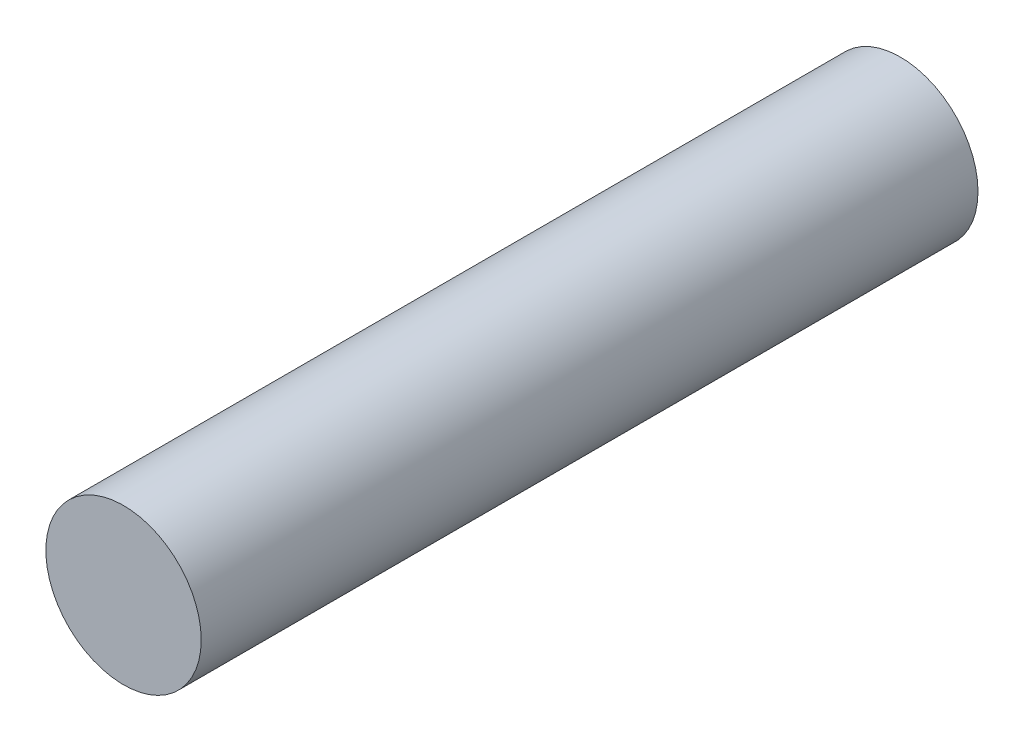
ISO-10303-21;
HEADER;
FILE_DESCRIPTION(('STEP AP214'),'2;1');
FILE_NAME('part.step','',(''),(''),'','','');
FILE_SCHEMA(('AUTOMOTIVE_DESIGN { 1 0 10303 214 1 1 1 1 }'));
ENDSEC;
DATA;
#1=APPLICATION_CONTEXT('core data for automotive mechanical design processes');
#2=APPLICATION_PROTOCOL_DEFINITION('international standard','automotive_design',2000,#1);
#3=PRODUCT_CONTEXT('',#1,'mechanical');
#4=PRODUCT('Part','Part','',(#3));
#5=PRODUCT_RELATED_PRODUCT_CATEGORY('part','',(#4));
#6=PRODUCT_DEFINITION_FORMATION('','',#4);
#7=PRODUCT_DEFINITION_CONTEXT('part definition',#1,'design');
#8=PRODUCT_DEFINITION('design','',#6,#7);
#9=PRODUCT_DEFINITION_SHAPE('','',#8);
#10=(LENGTH_UNIT() NAMED_UNIT(*) SI_UNIT(.MILLI.,.METRE.));
#11=(NAMED_UNIT(*) PLANE_ANGLE_UNIT() SI_UNIT($,.RADIAN.));
#12=(NAMED_UNIT(*) SI_UNIT($,.STERADIAN.) SOLID_ANGLE_UNIT());
#13=UNCERTAINTY_MEASURE_WITH_UNIT(LENGTH_MEASURE(1.E-05),#10,'distance_accuracy_value','');
#14=(GEOMETRIC_REPRESENTATION_CONTEXT(3) GLOBAL_UNCERTAINTY_ASSIGNED_CONTEXT((#13)) GLOBAL_UNIT_ASSIGNED_CONTEXT((#10,
#11,#12)) REPRESENTATION_CONTEXT('',''));
#15=CARTESIAN_POINT('',(0.,0.,0.));
#16=DIRECTION('',(0.,0.,1.));
#17=DIRECTION('',(1.,0.,0.));
#18=AXIS2_PLACEMENT_3D('',#15,#16,#17);
#19=CARTESIAN_POINT('',(0.,0.,50.));
#20=DIRECTION('',(0.,0.,-1.));
#21=DIRECTION('',(-1.,0.,0.));
#22=AXIS2_PLACEMENT_3D('',#19,#20,#21);
#23=CYLINDRICAL_SURFACE('',#22,5.);
#24=CARTESIAN_POINT('',(0.,0.,50.));
#25=DIRECTION('',(0.,0.,1.));
#26=DIRECTION('',(1.,0.,0.));
#27=AXIS2_PLACEMENT_3D('',#24,#25,#26);
#28=CIRCLE('',#27,5.);
#29=CARTESIAN_POINT('',(5.,0.,50.));
#30=VERTEX_POINT('',#29);
#31=EDGE_CURVE('E10',#30,#30,#28,.T.);
#32=ORIENTED_EDGE('',*,*,#31,.F.);
#33=EDGE_LOOP('',(#32));
#34=FACE_BOUND('',#33,.T.);
#35=CARTESIAN_POINT('',(0.,0.,0.));
#36=DIRECTION('',(0.,0.,1.));
#37=DIRECTION('',(1.,0.,0.));
#38=AXIS2_PLACEMENT_3D('',#35,#36,#37);
#39=CIRCLE('',#38,5.);
#40=CARTESIAN_POINT('',(5.,0.,0.));
#41=VERTEX_POINT('',#40);
#42=EDGE_CURVE('E37',#41,#41,#39,.T.);
#43=ORIENTED_EDGE('',*,*,#42,.T.);
#44=EDGE_LOOP('',(#43));
#45=FACE_BOUND('',#44,.T.);
#46=ADVANCED_FACE('F34',(#34,#45),#23,.T.);
#47=CARTESIAN_POINT('',(0.,0.,50.));
#48=DIRECTION('',(0.,0.,1.));
#49=DIRECTION('',(1.,0.,0.));
#50=AXIS2_PLACEMENT_3D('',#47,#48,#49);
#51=PLANE('',#50);
#52=ORIENTED_EDGE('',*,*,#31,.T.);
#53=EDGE_LOOP('',(#52));
#54=FACE_BOUND('',#53,.T.);
#55=ADVANCED_FACE('F49',(#54),#51,.T.);
#56=CARTESIAN_POINT('',(0.,0.,0.));
#57=DIRECTION('',(0.,0.,1.));
#58=DIRECTION('',(1.,0.,0.));
#59=AXIS2_PLACEMENT_3D('',#56,#57,#58);
#60=PLANE('',#59);
#61=ORIENTED_EDGE('',*,*,#42,.F.);
#62=EDGE_LOOP('',(#61));
#63=FACE_BOUND('',#62,.T.);
#64=ADVANCED_FACE('F47',(#63),#60,.F.);
#65=CLOSED_SHELL('',(#46,#55,#64));
#66=MANIFOLD_SOLID_BREP('B2',#65);
#67=ADVANCED_BREP_SHAPE_REPRESENTATION('',(#18,#66),#14);
#68=SHAPE_DEFINITION_REPRESENTATION(#9,#67);
ENDSEC;
END-ISO-10303-21;
